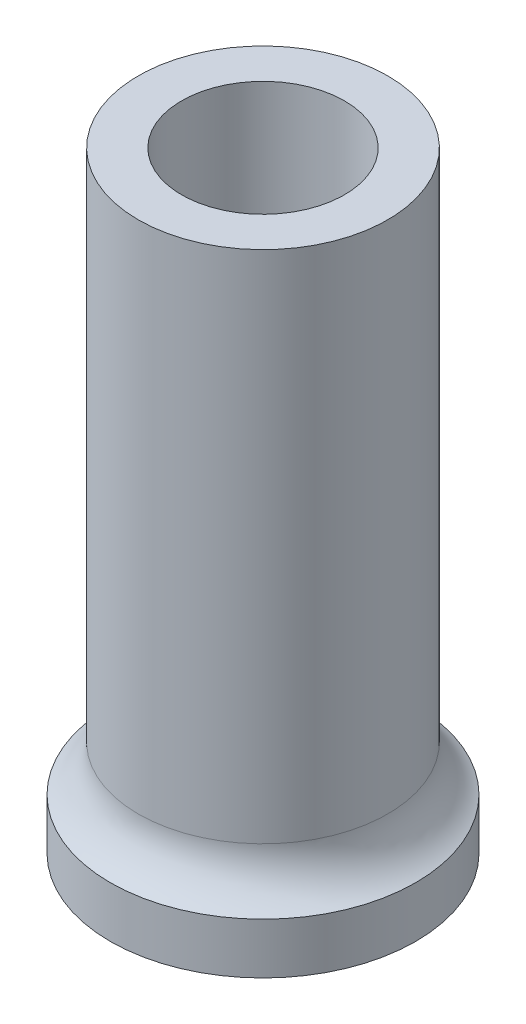
ISO-10303-21;
HEADER;
FILE_DESCRIPTION(('STEP AP214'),'2;1');
FILE_NAME('part.step','',(''),(''),'','','');
FILE_SCHEMA(('AUTOMOTIVE_DESIGN { 1 0 10303 214 1 1 1 1 }'));
ENDSEC;
DATA;
#1=APPLICATION_CONTEXT('core data for automotive mechanical design processes');
#2=APPLICATION_PROTOCOL_DEFINITION('international standard','automotive_design',2000,#1);
#3=PRODUCT_CONTEXT('',#1,'mechanical');
#4=PRODUCT('Part','Part','',(#3));
#5=PRODUCT_RELATED_PRODUCT_CATEGORY('part','',(#4));
#6=PRODUCT_DEFINITION_FORMATION('','',#4);
#7=PRODUCT_DEFINITION_CONTEXT('part definition',#1,'design');
#8=PRODUCT_DEFINITION('design','',#6,#7);
#9=PRODUCT_DEFINITION_SHAPE('','',#8);
#10=(LENGTH_UNIT() NAMED_UNIT(*) SI_UNIT(.MILLI.,.METRE.));
#11=(NAMED_UNIT(*) PLANE_ANGLE_UNIT() SI_UNIT($,.RADIAN.));
#12=(NAMED_UNIT(*) SI_UNIT($,.STERADIAN.) SOLID_ANGLE_UNIT());
#13=UNCERTAINTY_MEASURE_WITH_UNIT(LENGTH_MEASURE(1.E-05),#10,'distance_accuracy_value','');
#14=(GEOMETRIC_REPRESENTATION_CONTEXT(3) GLOBAL_UNCERTAINTY_ASSIGNED_CONTEXT((#13)) GLOBAL_UNIT_ASSIGNED_CONTEXT((#10,
#11,#12)) REPRESENTATION_CONTEXT('',''));
#15=CARTESIAN_POINT('',(0.,0.,0.));
#16=DIRECTION('',(0.,0.,1.));
#17=DIRECTION('',(1.,0.,0.));
#18=AXIS2_PLACEMENT_3D('',#15,#16,#17);
#19=CARTESIAN_POINT('',(0.,11.,0.));
#20=DIRECTION('',(0.,1.,0.));
#21=DIRECTION('',(0.,0.,1.));
#22=AXIS2_PLACEMENT_3D('',#19,#20,#21);
#23=PLANE('',#22);
#24=CARTESIAN_POINT('',(0.,11.,0.));
#25=DIRECTION('',(0.,-1.,0.));
#26=DIRECTION('',(0.,0.,-1.));
#27=AXIS2_PLACEMENT_3D('',#24,#25,#26);
#28=CIRCLE('',#27,1.6);
#29=CARTESIAN_POINT('',(0.,11.,-1.6));
#30=VERTEX_POINT('',#29);
#31=EDGE_CURVE('E50',#30,#30,#28,.T.);
#32=ORIENTED_EDGE('',*,*,#31,.T.);
#33=EDGE_LOOP('',(#32));
#34=FACE_BOUND('',#33,.T.);
#35=CARTESIAN_POINT('',(0.,11.,0.));
#36=DIRECTION('',(0.,1.,0.));
#37=DIRECTION('',(0.,0.,1.));
#38=AXIS2_PLACEMENT_3D('',#35,#36,#37);
#39=CIRCLE('',#38,2.45);
#40=CARTESIAN_POINT('',(0.,11.,2.45));
#41=VERTEX_POINT('',#40);
#42=EDGE_CURVE('E38',#41,#41,#39,.T.);
#43=ORIENTED_EDGE('',*,*,#42,.T.);
#44=EDGE_LOOP('',(#43));
#45=FACE_BOUND('',#44,.T.);
#46=ADVANCED_FACE('F31',(#34,#45),#23,.T.);
#47=CARTESIAN_POINT('',(0.,11.,0.));
#48=DIRECTION('',(0.,-1.,0.));
#49=DIRECTION('',(0.,0.,-1.));
#50=AXIS2_PLACEMENT_3D('',#47,#48,#49);
#51=CYLINDRICAL_SURFACE('',#50,2.45);
#52=CARTESIAN_POINT('',(0.,0.893028554974588,0.));
#53=DIRECTION('',(0.,-1.,0.));
#54=DIRECTION('',(0.,0.,-1.));
#55=AXIS2_PLACEMENT_3D('',#52,#53,#54);
#56=CIRCLE('',#55,2.45);
#57=CARTESIAN_POINT('',(0.,0.893028554974588,-2.45));
#58=VERTEX_POINT('',#57);
#59=EDGE_CURVE('E10',#58,#58,#56,.F.);
#60=ORIENTED_EDGE('',*,*,#59,.T.);
#61=EDGE_LOOP('',(#60));
#62=FACE_BOUND('',#61,.T.);
#63=ORIENTED_EDGE('',*,*,#42,.F.);
#64=EDGE_LOOP('',(#63));
#65=FACE_BOUND('',#64,.T.);
#66=ADVANCED_FACE('F74',(#62,#65),#51,.T.);
#67=CARTESIAN_POINT('',(0.,-1.,0.));
#68=DIRECTION('',(0.,1.,0.));
#69=DIRECTION('',(0.,0.,1.));
#70=AXIS2_PLACEMENT_3D('',#67,#68,#69);
#71=CYLINDRICAL_SURFACE('',#70,3.);
#72=CARTESIAN_POINT('',(0.,-1.,0.));
#73=DIRECTION('',(0.,-1.,0.));
#74=DIRECTION('',(0.,0.,-1.));
#75=AXIS2_PLACEMENT_3D('',#72,#73,#74);
#76=CIRCLE('',#75,3.);
#77=CARTESIAN_POINT('',(0.,-1.,-3.));
#78=VERTEX_POINT('',#77);
#79=EDGE_CURVE('E42',#78,#78,#76,.T.);
#80=ORIENTED_EDGE('',*,*,#79,.F.);
#81=EDGE_LOOP('',(#80));
#82=FACE_BOUND('',#81,.T.);
#83=CARTESIAN_POINT('',(0.,0.,0.));
#84=DIRECTION('',(0.,-1.,0.));
#85=DIRECTION('',(0.,0.,-1.));
#86=AXIS2_PLACEMENT_3D('',#83,#84,#85);
#87=CIRCLE('',#86,3.);
#88=CARTESIAN_POINT('',(0.,0.,-3.));
#89=VERTEX_POINT('',#88);
#90=EDGE_CURVE('E46',#89,#89,#87,.T.);
#91=ORIENTED_EDGE('',*,*,#90,.T.);
#92=EDGE_LOOP('',(#91));
#93=FACE_BOUND('',#92,.T.);
#94=ADVANCED_FACE('F68',(#82,#93),#71,.T.);
#95=CARTESIAN_POINT('',(0.,-1.,0.));
#96=DIRECTION('',(0.,-1.,0.));
#97=DIRECTION('',(0.,0.,-1.));
#98=AXIS2_PLACEMENT_3D('',#95,#96,#97);
#99=PLANE('',#98);
#100=CARTESIAN_POINT('',(0.,-1.,0.));
#101=DIRECTION('',(0.,-1.,0.));
#102=DIRECTION('',(0.,0.,-1.));
#103=AXIS2_PLACEMENT_3D('',#100,#101,#102);
#104=CIRCLE('',#103,1.6);
#105=CARTESIAN_POINT('',(0.,-1.,-1.6));
#106=VERTEX_POINT('',#105);
#107=EDGE_CURVE('E52',#106,#106,#104,.T.);
#108=ORIENTED_EDGE('',*,*,#107,.F.);
#109=EDGE_LOOP('',(#108));
#110=FACE_BOUND('',#109,.T.);
#111=ORIENTED_EDGE('',*,*,#79,.T.);
#112=EDGE_LOOP('',(#111));
#113=FACE_BOUND('',#112,.T.);
#114=ADVANCED_FACE('F62',(#110,#113),#99,.T.);
#115=CARTESIAN_POINT('',(0.,11.,0.));
#116=DIRECTION('',(0.,-1.,0.));
#117=DIRECTION('',(0.,0.,-1.));
#118=AXIS2_PLACEMENT_3D('',#115,#116,#117);
#119=CYLINDRICAL_SURFACE('',#118,1.6);
#120=ORIENTED_EDGE('',*,*,#31,.F.);
#121=EDGE_LOOP('',(#120));
#122=FACE_BOUND('',#121,.T.);
#123=ORIENTED_EDGE('',*,*,#107,.T.);
#124=EDGE_LOOP('',(#123));
#125=FACE_BOUND('',#124,.T.);
#126=ADVANCED_FACE('F59',(#122,#125),#119,.F.);
#127=CARTESIAN_POINT('',(0.,0.893028554974587,0.));
#128=DIRECTION('',(0.,-1.,0.));
#129=DIRECTION('',(0.,0.,-1.));
#130=AXIS2_PLACEMENT_3D('',#127,#128,#129);
#131=TOROIDAL_SURFACE('',#130,3.45,1.);
#132=ORIENTED_EDGE('',*,*,#59,.F.);
#133=EDGE_LOOP('',(#132));
#134=FACE_BOUND('',#133,.T.);
#135=ORIENTED_EDGE('',*,*,#90,.F.);
#136=EDGE_LOOP('',(#135));
#137=FACE_BOUND('',#136,.T.);
#138=ADVANCED_FACE('F33',(#134,#137),#131,.F.);
#139=CLOSED_SHELL('',(#46,#66,#94,#114,#126,#138));
#140=MANIFOLD_SOLID_BREP('B2',#139);
#141=ADVANCED_BREP_SHAPE_REPRESENTATION('',(#18,#140),#14);
#142=SHAPE_DEFINITION_REPRESENTATION(#9,#141);
ENDSEC;
END-ISO-10303-21;
